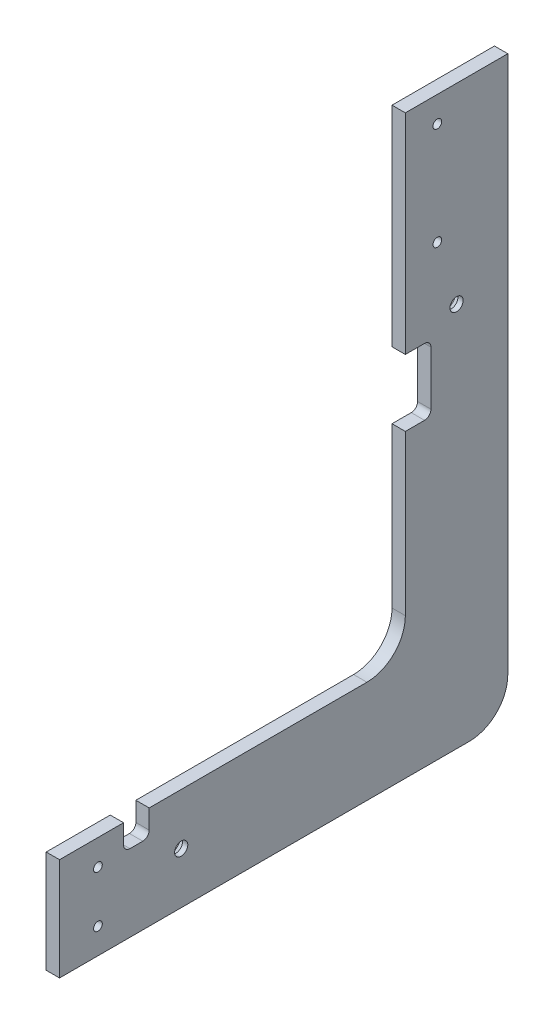
ISO-10303-21;
HEADER;
FILE_DESCRIPTION(('STEP AP214'),'2;1');
FILE_NAME('part.step','',(''),(''),'','','');
FILE_SCHEMA(('AUTOMOTIVE_DESIGN { 1 0 10303 214 1 1 1 1 }'));
ENDSEC;
DATA;
#1=APPLICATION_CONTEXT('core data for automotive mechanical design processes');
#2=APPLICATION_PROTOCOL_DEFINITION('international standard','automotive_design',2000,#1);
#3=PRODUCT_CONTEXT('',#1,'mechanical');
#4=PRODUCT('Part','Part','',(#3));
#5=PRODUCT_RELATED_PRODUCT_CATEGORY('part','',(#4));
#6=PRODUCT_DEFINITION_FORMATION('','',#4);
#7=PRODUCT_DEFINITION_CONTEXT('part definition',#1,'design');
#8=PRODUCT_DEFINITION('design','',#6,#7);
#9=PRODUCT_DEFINITION_SHAPE('','',#8);
#10=(LENGTH_UNIT() NAMED_UNIT(*) SI_UNIT(.MILLI.,.METRE.));
#11=(NAMED_UNIT(*) PLANE_ANGLE_UNIT() SI_UNIT($,.RADIAN.));
#12=(NAMED_UNIT(*) SI_UNIT($,.STERADIAN.) SOLID_ANGLE_UNIT());
#13=UNCERTAINTY_MEASURE_WITH_UNIT(LENGTH_MEASURE(1.E-05),#10,'distance_accuracy_value','');
#14=(GEOMETRIC_REPRESENTATION_CONTEXT(3) GLOBAL_UNCERTAINTY_ASSIGNED_CONTEXT((#13)) GLOBAL_UNIT_ASSIGNED_CONTEXT((#10,
#11,#12)) REPRESENTATION_CONTEXT('',''));
#15=CARTESIAN_POINT('',(0.,0.,0.));
#16=DIRECTION('',(0.,0.,1.));
#17=DIRECTION('',(1.,0.,0.));
#18=AXIS2_PLACEMENT_3D('',#15,#16,#17);
#19=CARTESIAN_POINT('',(6.604,-234.95,0.));
#20=DIRECTION('',(0.,1.,0.));
#21=DIRECTION('',(0.,0.,1.));
#22=AXIS2_PLACEMENT_3D('',#19,#20,#21);
#23=PLANE('',#22);
#24=DIRECTION('',(-1.,0.,0.));
#25=VECTOR('',#24,1.);
#26=CARTESIAN_POINT('',(6.604,-234.95,-44.45));
#27=LINE('',#26,#25);
#28=CARTESIAN_POINT('',(6.604,-234.95,-44.45));
#29=VERTEX_POINT('',#28);
#30=CARTESIAN_POINT('',(0.,-234.95,-44.45));
#31=VERTEX_POINT('',#30);
#32=EDGE_CURVE('E215',#29,#31,#27,.T.);
#33=ORIENTED_EDGE('',*,*,#32,.F.);
#34=DIRECTION('',(0.,0.,-1.));
#35=VECTOR('',#34,1.);
#36=CARTESIAN_POINT('',(6.604,-234.95,0.));
#37=LINE('',#36,#35);
#38=CARTESIAN_POINT('',(6.604,-234.95,-152.4));
#39=VERTEX_POINT('',#38);
#40=EDGE_CURVE('E195',#29,#39,#37,.T.);
#41=ORIENTED_EDGE('',*,*,#40,.T.);
#42=DIRECTION('',(-1.,0.,0.));
#43=VECTOR('',#42,1.);
#44=CARTESIAN_POINT('',(6.604,-234.95,-152.4));
#45=LINE('',#44,#43);
#46=CARTESIAN_POINT('',(0.,-234.95,-152.4));
#47=VERTEX_POINT('',#46);
#48=EDGE_CURVE('E44',#39,#47,#45,.T.);
#49=ORIENTED_EDGE('',*,*,#48,.T.);
#50=DIRECTION('',(0.,0.,-1.));
#51=VECTOR('',#50,1.);
#52=CARTESIAN_POINT('',(0.,-234.95,0.));
#53=LINE('',#52,#51);
#54=EDGE_CURVE('E348',#31,#47,#53,.T.);
#55=ORIENTED_EDGE('',*,*,#54,.F.);
#56=EDGE_LOOP('',(#33,#41,#49,#55));
#57=FACE_BOUND('',#56,.T.);
#58=ADVANCED_FACE('F36',(#57),#23,.T.);
#59=CARTESIAN_POINT('',(6.604,0.,-171.45));
#60=DIRECTION('',(0.,0.,-1.));
#61=DIRECTION('',(0.,1.,0.));
#62=AXIS2_PLACEMENT_3D('',#59,#60,#61);
#63=PLANE('',#62);
#64=DIRECTION('',(0.,-1.,0.));
#65=VECTOR('',#64,1.);
#66=CARTESIAN_POINT('',(6.604,0.,-171.45));
#67=LINE('',#66,#65);
#68=CARTESIAN_POINT('',(6.604,-136.779,-171.45));
#69=VERTEX_POINT('',#68);
#70=CARTESIAN_POINT('',(6.604,-215.9,-171.45));
#71=VERTEX_POINT('',#70);
#72=EDGE_CURVE('E324',#69,#71,#67,.T.);
#73=ORIENTED_EDGE('',*,*,#72,.F.);
#74=DIRECTION('',(-1.,0.,0.));
#75=VECTOR('',#74,1.);
#76=CARTESIAN_POINT('',(6.604,-136.779,-171.45));
#77=LINE('',#76,#75);
#78=CARTESIAN_POINT('',(0.,-136.779,-171.45));
#79=VERTEX_POINT('',#78);
#80=EDGE_CURVE('E253',#69,#79,#77,.T.);
#81=ORIENTED_EDGE('',*,*,#80,.T.);
#82=DIRECTION('',(0.,-1.,0.));
#83=VECTOR('',#82,1.);
#84=CARTESIAN_POINT('',(0.,0.,-171.45));
#85=LINE('',#84,#83);
#86=CARTESIAN_POINT('',(0.,-215.9,-171.45));
#87=VERTEX_POINT('',#86);
#88=EDGE_CURVE('E319',#79,#87,#85,.T.);
#89=ORIENTED_EDGE('',*,*,#88,.T.);
#90=DIRECTION('',(-1.,0.,0.));
#91=VECTOR('',#90,1.);
#92=CARTESIAN_POINT('',(6.604,-215.9,-171.45));
#93=LINE('',#92,#91);
#94=EDGE_CURVE('E11',#71,#87,#93,.T.);
#95=ORIENTED_EDGE('',*,*,#94,.F.);
#96=EDGE_LOOP('',(#73,#81,#89,#95));
#97=FACE_BOUND('',#96,.T.);
#98=ADVANCED_FACE('F449',(#97),#63,.F.);
#99=CARTESIAN_POINT('',(0.,0.,-171.45));
#100=VERTEX_POINT('',#99);
#101=CARTESIAN_POINT('',(0.,-103.759,-171.45));
#102=VERTEX_POINT('',#101);
#103=EDGE_CURVE('E342',#100,#102,#85,.T.);
#104=ORIENTED_EDGE('',*,*,#103,.T.);
#105=DIRECTION('',(-1.,0.,0.));
#106=VECTOR('',#105,1.);
#107=CARTESIAN_POINT('',(6.604,-103.759,-171.45));
#108=LINE('',#107,#106);
#109=CARTESIAN_POINT('',(6.604,-103.759,-171.45));
#110=VERTEX_POINT('',#109);
#111=EDGE_CURVE('E59',#110,#102,#108,.T.);
#112=ORIENTED_EDGE('',*,*,#111,.F.);
#113=CARTESIAN_POINT('',(6.604,0.,-171.45));
#114=VERTEX_POINT('',#113);
#115=EDGE_CURVE('E320',#114,#110,#67,.T.);
#116=ORIENTED_EDGE('',*,*,#115,.F.);
#117=DIRECTION('',(-1.,0.,0.));
#118=VECTOR('',#117,1.);
#119=CARTESIAN_POINT('',(6.604,0.,-171.45));
#120=LINE('',#119,#118);
#121=EDGE_CURVE('E341',#114,#100,#120,.T.);
#122=ORIENTED_EDGE('',*,*,#121,.T.);
#123=EDGE_LOOP('',(#104,#112,#116,#122));
#124=FACE_BOUND('',#123,.T.);
#125=ADVANCED_FACE('F38',(#124),#63,.F.);
#126=CARTESIAN_POINT('',(6.604,-215.9,-152.4));
#127=DIRECTION('',(-1.,0.,0.));
#128=DIRECTION('',(0.,0.,1.));
#129=AXIS2_PLACEMENT_3D('',#126,#127,#128);
#130=CYLINDRICAL_SURFACE('',#129,19.05);
#131=CARTESIAN_POINT('',(0.,-215.9,-152.4));
#132=DIRECTION('',(1.,0.,0.));
#133=DIRECTION('',(0.,0.,-1.));
#134=AXIS2_PLACEMENT_3D('',#131,#132,#133);
#135=CIRCLE('',#134,19.05);
#136=EDGE_CURVE('E345',#87,#47,#135,.F.);
#137=ORIENTED_EDGE('',*,*,#136,.T.);
#138=ORIENTED_EDGE('',*,*,#48,.F.);
#139=CARTESIAN_POINT('',(6.604,-215.9,-152.4));
#140=DIRECTION('',(1.,0.,0.));
#141=DIRECTION('',(0.,0.,-1.));
#142=AXIS2_PLACEMENT_3D('',#139,#140,#141);
#143=CIRCLE('',#142,19.05);
#144=EDGE_CURVE('E323',#71,#39,#143,.F.);
#145=ORIENTED_EDGE('',*,*,#144,.F.);
#146=ORIENTED_EDGE('',*,*,#94,.T.);
#147=EDGE_LOOP('',(#137,#138,#145,#146));
#148=FACE_BOUND('',#147,.T.);
#149=ADVANCED_FACE('F384',(#148),#130,.F.);
#150=DIRECTION('',(-1.,0.,0.));
#151=VECTOR('',#150,1.);
#152=CARTESIAN_POINT('',(6.604,-234.95,-31.75));
#153=LINE('',#152,#151);
#154=CARTESIAN_POINT('',(6.604,-234.95,-31.75));
#155=VERTEX_POINT('',#154);
#156=CARTESIAN_POINT('',(0.,-234.95,-31.75));
#157=VERTEX_POINT('',#156);
#158=EDGE_CURVE('E218',#155,#157,#153,.T.);
#159=ORIENTED_EDGE('',*,*,#158,.T.);
#160=CARTESIAN_POINT('',(0.,-234.95,0.));
#161=VERTEX_POINT('',#160);
#162=EDGE_CURVE('E349',#161,#157,#53,.T.);
#163=ORIENTED_EDGE('',*,*,#162,.F.);
#164=DIRECTION('',(-1.,0.,0.));
#165=VECTOR('',#164,1.);
#166=CARTESIAN_POINT('',(6.604,-234.95,0.));
#167=LINE('',#166,#165);
#168=CARTESIAN_POINT('',(6.604,-234.95,0.));
#169=VERTEX_POINT('',#168);
#170=EDGE_CURVE('E376',#169,#161,#167,.T.);
#171=ORIENTED_EDGE('',*,*,#170,.F.);
#172=EDGE_CURVE('E326',#169,#155,#37,.T.);
#173=ORIENTED_EDGE('',*,*,#172,.T.);
#174=EDGE_LOOP('',(#159,#163,#171,#173));
#175=FACE_BOUND('',#174,.T.);
#176=ADVANCED_FACE('F404',(#175),#23,.T.);
#177=CARTESIAN_POINT('',(6.604,0.,0.));
#178=DIRECTION('',(0.,0.,-1.));
#179=DIRECTION('',(-1.,0.,0.));
#180=AXIS2_PLACEMENT_3D('',#177,#178,#179);
#181=PLANE('',#180);
#182=DIRECTION('',(0.,-1.,0.));
#183=VECTOR('',#182,1.);
#184=CARTESIAN_POINT('',(0.,0.,0.));
#185=LINE('',#184,#183);
#186=CARTESIAN_POINT('',(0.,-285.75,0.));
#187=VERTEX_POINT('',#186);
#188=EDGE_CURVE('E352',#161,#187,#185,.T.);
#189=ORIENTED_EDGE('',*,*,#188,.T.);
#190=DIRECTION('',(-1.,0.,0.));
#191=VECTOR('',#190,1.);
#192=CARTESIAN_POINT('',(6.604,-285.75,0.));
#193=LINE('',#192,#191);
#194=CARTESIAN_POINT('',(6.604,-285.75,0.));
#195=VERTEX_POINT('',#194);
#196=EDGE_CURVE('E373',#195,#187,#193,.T.);
#197=ORIENTED_EDGE('',*,*,#196,.F.);
#198=DIRECTION('',(0.,-1.,0.));
#199=VECTOR('',#198,1.);
#200=CARTESIAN_POINT('',(6.604,0.,0.));
#201=LINE('',#200,#199);
#202=EDGE_CURVE('E329',#169,#195,#201,.T.);
#203=ORIENTED_EDGE('',*,*,#202,.F.);
#204=ORIENTED_EDGE('',*,*,#170,.T.);
#205=EDGE_LOOP('',(#189,#197,#203,#204));
#206=FACE_BOUND('',#205,.T.);
#207=ADVANCED_FACE('F410',(#206),#181,.F.);
#208=CARTESIAN_POINT('',(6.604,-285.75,0.));
#209=DIRECTION('',(0.,1.,0.));
#210=DIRECTION('',(0.,0.,1.));
#211=AXIS2_PLACEMENT_3D('',#208,#209,#210);
#212=PLANE('',#211);
#213=DIRECTION('',(0.,0.,-1.));
#214=VECTOR('',#213,1.);
#215=CARTESIAN_POINT('',(0.,-285.75,0.));
#216=LINE('',#215,#214);
#217=CARTESIAN_POINT('',(0.,-285.75,-203.2));
#218=VERTEX_POINT('',#217);
#219=EDGE_CURVE('E354',#187,#218,#216,.T.);
#220=ORIENTED_EDGE('',*,*,#219,.T.);
#221=DIRECTION('',(-1.,0.,0.));
#222=VECTOR('',#221,1.);
#223=CARTESIAN_POINT('',(6.604,-285.75,-203.2));
#224=LINE('',#223,#222);
#225=CARTESIAN_POINT('',(6.604,-285.75,-203.2));
#226=VERTEX_POINT('',#225);
#227=EDGE_CURVE('E370',#226,#218,#224,.T.);
#228=ORIENTED_EDGE('',*,*,#227,.F.);
#229=DIRECTION('',(0.,0.,-1.));
#230=VECTOR('',#229,1.);
#231=CARTESIAN_POINT('',(6.604,-285.75,0.));
#232=LINE('',#231,#230);
#233=EDGE_CURVE('E331',#195,#226,#232,.T.);
#234=ORIENTED_EDGE('',*,*,#233,.F.);
#235=ORIENTED_EDGE('',*,*,#196,.T.);
#236=EDGE_LOOP('',(#220,#228,#234,#235));
#237=FACE_BOUND('',#236,.T.);
#238=ADVANCED_FACE('F414',(#237),#212,.F.);
#239=CARTESIAN_POINT('',(6.604,-266.7,-203.2));
#240=DIRECTION('',(-1.,0.,0.));
#241=DIRECTION('',(0.,0.,1.));
#242=AXIS2_PLACEMENT_3D('',#239,#240,#241);
#243=CYLINDRICAL_SURFACE('',#242,19.0500000000001);
#244=CARTESIAN_POINT('',(0.,-266.7,-203.2));
#245=DIRECTION('',(1.,0.,0.));
#246=DIRECTION('',(0.,0.,-1.));
#247=AXIS2_PLACEMENT_3D('',#244,#245,#246);
#248=CIRCLE('',#247,19.0500000000001);
#249=CARTESIAN_POINT('',(0.,-266.7,-222.25));
#250=VERTEX_POINT('',#249);
#251=EDGE_CURVE('E356',#218,#250,#248,.T.);
#252=ORIENTED_EDGE('',*,*,#251,.T.);
#253=DIRECTION('',(-1.,0.,0.));
#254=VECTOR('',#253,1.);
#255=CARTESIAN_POINT('',(6.604,-266.7,-222.25));
#256=LINE('',#255,#254);
#257=CARTESIAN_POINT('',(6.604,-266.7,-222.25));
#258=VERTEX_POINT('',#257);
#259=EDGE_CURVE('E368',#258,#250,#256,.T.);
#260=ORIENTED_EDGE('',*,*,#259,.F.);
#261=CARTESIAN_POINT('',(6.604,-266.7,-203.2));
#262=DIRECTION('',(1.,0.,0.));
#263=DIRECTION('',(0.,0.,-1.));
#264=AXIS2_PLACEMENT_3D('',#261,#262,#263);
#265=CIRCLE('',#264,19.0500000000001);
#266=EDGE_CURVE('E333',#226,#258,#265,.T.);
#267=ORIENTED_EDGE('',*,*,#266,.F.);
#268=ORIENTED_EDGE('',*,*,#227,.T.);
#269=EDGE_LOOP('',(#252,#260,#267,#268));
#270=FACE_BOUND('',#269,.T.);
#271=ADVANCED_FACE('F421',(#270),#243,.T.);
#272=CARTESIAN_POINT('',(6.604,0.,-222.25));
#273=DIRECTION('',(0.,0.,-1.));
#274=DIRECTION('',(0.,1.,0.));
#275=AXIS2_PLACEMENT_3D('',#272,#273,#274);
#276=PLANE('',#275);
#277=DIRECTION('',(0.,-1.,0.));
#278=VECTOR('',#277,1.);
#279=CARTESIAN_POINT('',(0.,0.,-222.25));
#280=LINE('',#279,#278);
#281=CARTESIAN_POINT('',(0.,0.,-222.25));
#282=VERTEX_POINT('',#281);
#283=EDGE_CURVE('E359',#282,#250,#280,.T.);
#284=ORIENTED_EDGE('',*,*,#283,.F.);
#285=DIRECTION('',(-1.,0.,0.));
#286=VECTOR('',#285,1.);
#287=CARTESIAN_POINT('',(6.604,0.,-222.25));
#288=LINE('',#287,#286);
#289=CARTESIAN_POINT('',(6.604,0.,-222.25));
#290=VERTEX_POINT('',#289);
#291=EDGE_CURVE('E366',#290,#282,#288,.T.);
#292=ORIENTED_EDGE('',*,*,#291,.F.);
#293=DIRECTION('',(0.,-1.,0.));
#294=VECTOR('',#293,1.);
#295=CARTESIAN_POINT('',(6.604,0.,-222.25));
#296=LINE('',#295,#294);
#297=EDGE_CURVE('E335',#290,#258,#296,.T.);
#298=ORIENTED_EDGE('',*,*,#297,.T.);
#299=ORIENTED_EDGE('',*,*,#259,.T.);
#300=EDGE_LOOP('',(#284,#292,#298,#299));
#301=FACE_BOUND('',#300,.T.);
#302=ADVANCED_FACE('F424',(#301),#276,.T.);
#303=CARTESIAN_POINT('',(6.604,0.,0.));
#304=DIRECTION('',(0.,1.,0.));
#305=DIRECTION('',(0.,0.,1.));
#306=AXIS2_PLACEMENT_3D('',#303,#304,#305);
#307=PLANE('',#306);
#308=DIRECTION('',(0.,0.,-1.));
#309=VECTOR('',#308,1.);
#310=CARTESIAN_POINT('',(0.,0.,0.));
#311=LINE('',#310,#309);
#312=EDGE_CURVE('E362',#100,#282,#311,.T.);
#313=ORIENTED_EDGE('',*,*,#312,.F.);
#314=ORIENTED_EDGE('',*,*,#121,.F.);
#315=DIRECTION('',(0.,0.,-1.));
#316=VECTOR('',#315,1.);
#317=CARTESIAN_POINT('',(6.604,0.,0.));
#318=LINE('',#317,#316);
#319=EDGE_CURVE('E338',#114,#290,#318,.T.);
#320=ORIENTED_EDGE('',*,*,#319,.T.);
#321=ORIENTED_EDGE('',*,*,#291,.T.);
#322=EDGE_LOOP('',(#313,#314,#320,#321));
#323=FACE_BOUND('',#322,.T.);
#324=ADVANCED_FACE('F427',(#323),#307,.T.);
#325=CARTESIAN_POINT('',(6.604,0.,0.));
#326=DIRECTION('',(1.,0.,0.));
#327=DIRECTION('',(0.,0.,-1.));
#328=AXIS2_PLACEMENT_3D('',#325,#326,#327);
#329=PLANE('',#328);
#330=DIRECTION('',(0.,-1.,0.));
#331=VECTOR('',#330,1.);
#332=CARTESIAN_POINT('',(6.604,-234.95,-44.45));
#333=LINE('',#332,#331);
#334=CARTESIAN_POINT('',(6.604,-244.475,-44.45));
#335=VERTEX_POINT('',#334);
#336=EDGE_CURVE('E175',#29,#335,#333,.T.);
#337=ORIENTED_EDGE('',*,*,#336,.T.);
#338=CARTESIAN_POINT('',(6.604,-244.475,-41.275));
#339=DIRECTION('',(-1.,0.,0.));
#340=DIRECTION('',(0.,0.,-1.));
#341=AXIS2_PLACEMENT_3D('',#338,#339,#340);
#342=CIRCLE('',#341,3.17500000000001);
#343=CARTESIAN_POINT('',(6.604,-247.65,-41.275));
#344=VERTEX_POINT('',#343);
#345=EDGE_CURVE('E184',#335,#344,#342,.T.);
#346=ORIENTED_EDGE('',*,*,#345,.T.);
#347=DIRECTION('',(0.,0.,1.));
#348=VECTOR('',#347,1.);
#349=CARTESIAN_POINT('',(6.604,-247.65,-41.275));
#350=LINE('',#349,#348);
#351=CARTESIAN_POINT('',(6.604,-247.65,-34.925));
#352=VERTEX_POINT('',#351);
#353=EDGE_CURVE('E189',#344,#352,#350,.T.);
#354=ORIENTED_EDGE('',*,*,#353,.T.);
#355=CARTESIAN_POINT('',(6.604,-244.475,-34.925));
#356=DIRECTION('',(-1.,0.,0.));
#357=DIRECTION('',(0.,0.,1.));
#358=AXIS2_PLACEMENT_3D('',#355,#356,#357);
#359=CIRCLE('',#358,3.175);
#360=CARTESIAN_POINT('',(6.604,-244.475,-31.75));
#361=VERTEX_POINT('',#360);
#362=EDGE_CURVE('E202',#352,#361,#359,.T.);
#363=ORIENTED_EDGE('',*,*,#362,.T.);
#364=DIRECTION('',(0.,1.,0.));
#365=VECTOR('',#364,1.);
#366=CARTESIAN_POINT('',(6.604,-234.95,-31.75));
#367=LINE('',#366,#365);
#368=EDGE_CURVE('E181',#361,#155,#367,.T.);
#369=ORIENTED_EDGE('',*,*,#368,.T.);
#370=ORIENTED_EDGE('',*,*,#172,.F.);
#371=ORIENTED_EDGE('',*,*,#202,.T.);
#372=ORIENTED_EDGE('',*,*,#233,.T.);
#373=ORIENTED_EDGE('',*,*,#266,.T.);
#374=ORIENTED_EDGE('',*,*,#297,.F.);
#375=ORIENTED_EDGE('',*,*,#319,.F.);
#376=ORIENTED_EDGE('',*,*,#115,.T.);
#377=DIRECTION('',(0.,0.,-1.));
#378=VECTOR('',#377,1.);
#379=CARTESIAN_POINT('',(6.604,-103.759,-171.45));
#380=LINE('',#379,#378);
#381=CARTESIAN_POINT('',(6.604,-103.759,-180.975));
#382=VERTEX_POINT('',#381);
#383=EDGE_CURVE('E226',#110,#382,#380,.T.);
#384=ORIENTED_EDGE('',*,*,#383,.T.);
#385=CARTESIAN_POINT('',(6.604,-106.934,-180.975));
#386=DIRECTION('',(-1.,0.,0.));
#387=DIRECTION('',(0.,0.,-1.));
#388=AXIS2_PLACEMENT_3D('',#385,#386,#387);
#389=CIRCLE('',#388,3.175);
#390=CARTESIAN_POINT('',(6.604,-106.934,-184.15));
#391=VERTEX_POINT('',#390);
#392=EDGE_CURVE('E229',#382,#391,#389,.T.);
#393=ORIENTED_EDGE('',*,*,#392,.T.);
#394=DIRECTION('',(0.,-1.,0.));
#395=VECTOR('',#394,1.);
#396=CARTESIAN_POINT('',(6.604,-106.934,-184.15));
#397=LINE('',#396,#395);
#398=CARTESIAN_POINT('',(6.604,-133.604,-184.15));
#399=VERTEX_POINT('',#398);
#400=EDGE_CURVE('E233',#391,#399,#397,.T.);
#401=ORIENTED_EDGE('',*,*,#400,.T.);
#402=CARTESIAN_POINT('',(6.604,-133.604,-180.975));
#403=DIRECTION('',(-1.,0.,0.));
#404=DIRECTION('',(0.,0.,-1.));
#405=AXIS2_PLACEMENT_3D('',#402,#403,#404);
#406=CIRCLE('',#405,3.175);
#407=CARTESIAN_POINT('',(6.604,-136.779,-180.975));
#408=VERTEX_POINT('',#407);
#409=EDGE_CURVE('E236',#399,#408,#406,.T.);
#410=ORIENTED_EDGE('',*,*,#409,.T.);
#411=DIRECTION('',(0.,0.,1.));
#412=VECTOR('',#411,1.);
#413=CARTESIAN_POINT('',(6.604,-136.779,-171.45));
#414=LINE('',#413,#412);
#415=EDGE_CURVE('E239',#408,#69,#414,.T.);
#416=ORIENTED_EDGE('',*,*,#415,.T.);
#417=ORIENTED_EDGE('',*,*,#72,.T.);
#418=ORIENTED_EDGE('',*,*,#144,.T.);
#419=ORIENTED_EDGE('',*,*,#40,.F.);
#420=EDGE_LOOP('',(#337,#346,#354,#363,#369,#370,#371,#372,#373,#374,#375,#376,#384,#393,#401,
#410,#416,#417,#418,#419));
#421=FACE_BOUND('',#420,.T.);
#422=CARTESIAN_POINT('',(6.604,-94.869,-196.85));
#423=DIRECTION('',(-1.,0.,0.));
#424=DIRECTION('',(0.,0.,1.));
#425=AXIS2_PLACEMENT_3D('',#422,#423,#424);
#426=CIRCLE('',#425,3.2639);
#427=CARTESIAN_POINT('',(6.604,-94.869,-193.5861));
#428=VERTEX_POINT('',#427);
#429=EDGE_CURVE('E271',#428,#428,#426,.T.);
#430=ORIENTED_EDGE('',*,*,#429,.T.);
#431=EDGE_LOOP('',(#430));
#432=FACE_BOUND('',#431,.T.);
#433=CARTESIAN_POINT('',(6.604,-260.35,-60.325));
#434=DIRECTION('',(-1.,0.,0.));
#435=DIRECTION('',(0.,0.,1.));
#436=AXIS2_PLACEMENT_3D('',#433,#434,#435);
#437=CIRCLE('',#436,3.26389999999999);
#438=CARTESIAN_POINT('',(6.604,-260.35,-57.0611));
#439=VERTEX_POINT('',#438);
#440=EDGE_CURVE('E280',#439,#439,#437,.T.);
#441=ORIENTED_EDGE('',*,*,#440,.T.);
#442=EDGE_LOOP('',(#441));
#443=FACE_BOUND('',#442,.T.);
#444=CARTESIAN_POINT('',(6.604,-247.65,-19.05));
#445=DIRECTION('',(-1.,0.,0.));
#446=DIRECTION('',(0.,0.,1.));
#447=AXIS2_PLACEMENT_3D('',#444,#445,#446);
#448=CIRCLE('',#447,2.15265000000001);
#449=CARTESIAN_POINT('',(6.604,-247.65,-16.89735));
#450=VERTEX_POINT('',#449);
#451=EDGE_CURVE('E289',#450,#450,#448,.T.);
#452=ORIENTED_EDGE('',*,*,#451,.T.);
#453=EDGE_LOOP('',(#452));
#454=FACE_BOUND('',#453,.T.);
#455=CARTESIAN_POINT('',(6.604,-273.05,-19.05));
#456=DIRECTION('',(-1.,0.,0.));
#457=DIRECTION('',(0.,0.,1.));
#458=AXIS2_PLACEMENT_3D('',#455,#456,#457);
#459=CIRCLE('',#458,2.15264999999998);
#460=CARTESIAN_POINT('',(6.604,-273.05,-16.89735));
#461=VERTEX_POINT('',#460);
#462=EDGE_CURVE('E298',#461,#461,#459,.T.);
#463=ORIENTED_EDGE('',*,*,#462,.T.);
#464=EDGE_LOOP('',(#463));
#465=FACE_BOUND('',#464,.T.);
#466=CARTESIAN_POINT('',(6.604,-12.7,-187.325));
#467=DIRECTION('',(-1.,0.,0.));
#468=DIRECTION('',(0.,0.,1.));
#469=AXIS2_PLACEMENT_3D('',#466,#467,#468);
#470=CIRCLE('',#469,2.15265);
#471=CARTESIAN_POINT('',(6.604,-12.7,-185.17235));
#472=VERTEX_POINT('',#471);
#473=EDGE_CURVE('E307',#472,#472,#470,.T.);
#474=ORIENTED_EDGE('',*,*,#473,.T.);
#475=EDGE_LOOP('',(#474));
#476=FACE_BOUND('',#475,.T.);
#477=CARTESIAN_POINT('',(6.604,-63.5,-187.325));
#478=DIRECTION('',(-1.,0.,0.));
#479=DIRECTION('',(0.,0.,1.));
#480=AXIS2_PLACEMENT_3D('',#477,#478,#479);
#481=CIRCLE('',#480,2.15265);
#482=CARTESIAN_POINT('',(6.604,-63.5,-185.17235));
#483=VERTEX_POINT('',#482);
#484=EDGE_CURVE('E316',#483,#483,#481,.T.);
#485=ORIENTED_EDGE('',*,*,#484,.T.);
#486=EDGE_LOOP('',(#485));
#487=FACE_BOUND('',#486,.T.);
#488=ADVANCED_FACE('F192',(#421,#432,#443,#454,#465,#476,#487),#329,.T.);
#489=CARTESIAN_POINT('',(0.,0.,0.));
#490=DIRECTION('',(1.,0.,0.));
#491=DIRECTION('',(0.,0.,-1.));
#492=AXIS2_PLACEMENT_3D('',#489,#490,#491);
#493=PLANE('',#492);
#494=CARTESIAN_POINT('',(0.,-94.869,-196.85));
#495=DIRECTION('',(-1.,0.,0.));
#496=DIRECTION('',(0.,0.,1.));
#497=AXIS2_PLACEMENT_3D('',#494,#495,#496);
#498=CIRCLE('',#497,6.7437);
#499=CARTESIAN_POINT('',(0.,-94.869,-190.1063));
#500=VERTEX_POINT('',#499);
#501=EDGE_CURVE('E256',#500,#500,#498,.T.);
#502=ORIENTED_EDGE('',*,*,#501,.F.);
#503=EDGE_LOOP('',(#502));
#504=FACE_BOUND('',#503,.T.);
#505=CARTESIAN_POINT('',(0.,-260.35,-60.325));
#506=DIRECTION('',(-1.,0.,0.));
#507=DIRECTION('',(0.,0.,1.));
#508=AXIS2_PLACEMENT_3D('',#505,#506,#507);
#509=CIRCLE('',#508,6.74370000000002);
#510=CARTESIAN_POINT('',(0.,-260.35,-53.5813));
#511=VERTEX_POINT('',#510);
#512=EDGE_CURVE('E274',#511,#511,#509,.T.);
#513=ORIENTED_EDGE('',*,*,#512,.F.);
#514=EDGE_LOOP('',(#513));
#515=FACE_BOUND('',#514,.T.);
#516=CARTESIAN_POINT('',(0.,-247.65,-19.05));
#517=DIRECTION('',(-1.,0.,0.));
#518=DIRECTION('',(0.,0.,1.));
#519=AXIS2_PLACEMENT_3D('',#516,#517,#518);
#520=CIRCLE('',#519,4.55929999999999);
#521=CARTESIAN_POINT('',(0.,-247.65,-14.4907000000001));
#522=VERTEX_POINT('',#521);
#523=EDGE_CURVE('E283',#522,#522,#520,.T.);
#524=ORIENTED_EDGE('',*,*,#523,.F.);
#525=EDGE_LOOP('',(#524));
#526=FACE_BOUND('',#525,.T.);
#527=CARTESIAN_POINT('',(0.,-273.05,-19.05));
#528=DIRECTION('',(-1.,0.,0.));
#529=DIRECTION('',(0.,0.,1.));
#530=AXIS2_PLACEMENT_3D('',#527,#528,#529);
#531=CIRCLE('',#530,4.55929999999999);
#532=CARTESIAN_POINT('',(0.,-273.05,-14.4907));
#533=VERTEX_POINT('',#532);
#534=EDGE_CURVE('E292',#533,#533,#531,.T.);
#535=ORIENTED_EDGE('',*,*,#534,.F.);
#536=EDGE_LOOP('',(#535));
#537=FACE_BOUND('',#536,.T.);
#538=CARTESIAN_POINT('',(0.,-12.7,-187.325));
#539=DIRECTION('',(-1.,0.,0.));
#540=DIRECTION('',(0.,0.,1.));
#541=AXIS2_PLACEMENT_3D('',#538,#539,#540);
#542=CIRCLE('',#541,4.5593);
#543=CARTESIAN_POINT('',(0.,-12.7,-182.7657));
#544=VERTEX_POINT('',#543);
#545=EDGE_CURVE('E301',#544,#544,#542,.T.);
#546=ORIENTED_EDGE('',*,*,#545,.F.);
#547=EDGE_LOOP('',(#546));
#548=FACE_BOUND('',#547,.T.);
#549=CARTESIAN_POINT('',(0.,-63.5,-187.325));
#550=DIRECTION('',(-1.,0.,0.));
#551=DIRECTION('',(0.,0.,1.));
#552=AXIS2_PLACEMENT_3D('',#549,#550,#551);
#553=CIRCLE('',#552,4.5593);
#554=CARTESIAN_POINT('',(0.,-63.5,-182.7657));
#555=VERTEX_POINT('',#554);
#556=EDGE_CURVE('E310',#555,#555,#553,.T.);
#557=ORIENTED_EDGE('',*,*,#556,.F.);
#558=EDGE_LOOP('',(#557));
#559=FACE_BOUND('',#558,.T.);
#560=CARTESIAN_POINT('',(0.,-244.475,-41.275));
#561=DIRECTION('',(-1.,0.,0.));
#562=DIRECTION('',(0.,0.,-1.));
#563=AXIS2_PLACEMENT_3D('',#560,#561,#562);
#564=CIRCLE('',#563,3.17500000000001);
#565=CARTESIAN_POINT('',(0.,-244.475,-44.45));
#566=VERTEX_POINT('',#565);
#567=CARTESIAN_POINT('',(0.,-247.65,-41.275));
#568=VERTEX_POINT('',#567);
#569=EDGE_CURVE('E208',#566,#568,#564,.T.);
#570=ORIENTED_EDGE('',*,*,#569,.F.);
#571=DIRECTION('',(0.,-1.,0.));
#572=VECTOR('',#571,1.);
#573=CARTESIAN_POINT('',(0.,-234.95,-44.45));
#574=LINE('',#573,#572);
#575=EDGE_CURVE('E51',#31,#566,#574,.T.);
#576=ORIENTED_EDGE('',*,*,#575,.F.);
#577=ORIENTED_EDGE('',*,*,#54,.T.);
#578=ORIENTED_EDGE('',*,*,#136,.F.);
#579=ORIENTED_EDGE('',*,*,#88,.F.);
#580=DIRECTION('',(0.,0.,1.));
#581=VECTOR('',#580,1.);
#582=CARTESIAN_POINT('',(0.,-136.779,-171.45));
#583=LINE('',#582,#581);
#584=CARTESIAN_POINT('',(0.,-136.779,-180.975));
#585=VERTEX_POINT('',#584);
#586=EDGE_CURVE('E230',#585,#79,#583,.T.);
#587=ORIENTED_EDGE('',*,*,#586,.F.);
#588=CARTESIAN_POINT('',(0.,-133.604,-180.975));
#589=DIRECTION('',(-1.,0.,0.));
#590=DIRECTION('',(0.,0.,-1.));
#591=AXIS2_PLACEMENT_3D('',#588,#589,#590);
#592=CIRCLE('',#591,3.175);
#593=CARTESIAN_POINT('',(0.,-133.604,-184.15));
#594=VERTEX_POINT('',#593);
#595=EDGE_CURVE('E249',#594,#585,#592,.T.);
#596=ORIENTED_EDGE('',*,*,#595,.F.);
#597=DIRECTION('',(0.,-1.,0.));
#598=VECTOR('',#597,1.);
#599=CARTESIAN_POINT('',(0.,-106.934,-184.15));
#600=LINE('',#599,#598);
#601=CARTESIAN_POINT('',(0.,-106.934,-184.15));
#602=VERTEX_POINT('',#601);
#603=EDGE_CURVE('E246',#602,#594,#600,.T.);
#604=ORIENTED_EDGE('',*,*,#603,.F.);
#605=CARTESIAN_POINT('',(0.,-106.934,-180.975));
#606=DIRECTION('',(-1.,0.,0.));
#607=DIRECTION('',(0.,0.,-1.));
#608=AXIS2_PLACEMENT_3D('',#605,#606,#607);
#609=CIRCLE('',#608,3.175);
#610=CARTESIAN_POINT('',(0.,-103.759,-180.975));
#611=VERTEX_POINT('',#610);
#612=EDGE_CURVE('E243',#611,#602,#609,.T.);
#613=ORIENTED_EDGE('',*,*,#612,.F.);
#614=DIRECTION('',(0.,0.,-1.));
#615=VECTOR('',#614,1.);
#616=CARTESIAN_POINT('',(0.,-103.759,-171.45));
#617=LINE('',#616,#615);
#618=EDGE_CURVE('E217',#102,#611,#617,.T.);
#619=ORIENTED_EDGE('',*,*,#618,.F.);
#620=ORIENTED_EDGE('',*,*,#103,.F.);
#621=ORIENTED_EDGE('',*,*,#312,.T.);
#622=ORIENTED_EDGE('',*,*,#283,.T.);
#623=ORIENTED_EDGE('',*,*,#251,.F.);
#624=ORIENTED_EDGE('',*,*,#219,.F.);
#625=ORIENTED_EDGE('',*,*,#188,.F.);
#626=ORIENTED_EDGE('',*,*,#162,.T.);
#627=DIRECTION('',(0.,1.,0.));
#628=VECTOR('',#627,1.);
#629=CARTESIAN_POINT('',(0.,-234.95,-31.75));
#630=LINE('',#629,#628);
#631=CARTESIAN_POINT('',(0.,-244.475,-31.75));
#632=VERTEX_POINT('',#631);
#633=EDGE_CURVE('E196',#632,#157,#630,.T.);
#634=ORIENTED_EDGE('',*,*,#633,.F.);
#635=CARTESIAN_POINT('',(0.,-244.475,-34.925));
#636=DIRECTION('',(-1.,0.,0.));
#637=DIRECTION('',(0.,0.,1.));
#638=AXIS2_PLACEMENT_3D('',#635,#636,#637);
#639=CIRCLE('',#638,3.175);
#640=CARTESIAN_POINT('',(0.,-247.65,-34.925));
#641=VERTEX_POINT('',#640);
#642=EDGE_CURVE('E198',#641,#632,#639,.T.);
#643=ORIENTED_EDGE('',*,*,#642,.F.);
#644=DIRECTION('',(0.,0.,1.));
#645=VECTOR('',#644,1.);
#646=CARTESIAN_POINT('',(0.,-247.65,-41.275));
#647=LINE('',#646,#645);
#648=EDGE_CURVE('E210',#568,#641,#647,.T.);
#649=ORIENTED_EDGE('',*,*,#648,.F.);
#650=EDGE_LOOP('',(#570,#576,#577,#578,#579,#587,#596,#604,#613,#619,#620,#621,#622,#623,#624,
#625,#626,#634,#643,#649));
#651=FACE_BOUND('',#650,.T.);
#652=ADVANCED_FACE('F388',(#504,#515,#526,#537,#548,#559,#651),#493,.F.);
#653=CARTESIAN_POINT('',(0.,-63.5,-187.325));
#654=DIRECTION('',(-1.,0.,0.));
#655=DIRECTION('',(0.,0.,1.));
#656=AXIS2_PLACEMENT_3D('',#653,#654,#655);
#657=CYLINDRICAL_SURFACE('',#656,2.15265);
#658=ORIENTED_EDGE('',*,*,#484,.F.);
#659=EDGE_LOOP('',(#658));
#660=FACE_BOUND('',#659,.T.);
#661=CARTESIAN_POINT('',(2.76853412723844,-63.5,-187.325));
#662=DIRECTION('',(-1.,0.,0.));
#663=DIRECTION('',(0.,0.,1.));
#664=AXIS2_PLACEMENT_3D('',#661,#662,#663);
#665=CIRCLE('',#664,2.15265);
#666=CARTESIAN_POINT('',(2.76853412723844,-63.5,-185.17235));
#667=VERTEX_POINT('',#666);
#668=EDGE_CURVE('E313',#667,#667,#665,.T.);
#669=ORIENTED_EDGE('',*,*,#668,.T.);
#670=EDGE_LOOP('',(#669));
#671=FACE_BOUND('',#670,.T.);
#672=ADVANCED_FACE('F497',(#660,#671),#657,.F.);
#673=CARTESIAN_POINT('',(0.,-63.5,-187.325));
#674=DIRECTION('',(-1.,0.,0.));
#675=DIRECTION('',(0.,0.,1.));
#676=AXIS2_PLACEMENT_3D('',#673,#674,#675);
#677=CONICAL_SURFACE('',#676,4.5593,0.715584993317676);
#678=ORIENTED_EDGE('',*,*,#668,.F.);
#679=EDGE_LOOP('',(#678));
#680=FACE_BOUND('',#679,.T.);
#681=ORIENTED_EDGE('',*,*,#556,.T.);
#682=EDGE_LOOP('',(#681));
#683=FACE_BOUND('',#682,.T.);
#684=ADVANCED_FACE('F625',(#680,#683),#677,.F.);
#685=CARTESIAN_POINT('',(0.,-12.7,-187.325));
#686=DIRECTION('',(-1.,0.,0.));
#687=DIRECTION('',(0.,0.,1.));
#688=AXIS2_PLACEMENT_3D('',#685,#686,#687);
#689=CYLINDRICAL_SURFACE('',#688,2.15265);
#690=ORIENTED_EDGE('',*,*,#473,.F.);
#691=EDGE_LOOP('',(#690));
#692=FACE_BOUND('',#691,.T.);
#693=CARTESIAN_POINT('',(2.76853412723844,-12.7,-187.325));
#694=DIRECTION('',(-1.,0.,0.));
#695=DIRECTION('',(0.,0.,1.));
#696=AXIS2_PLACEMENT_3D('',#693,#694,#695);
#697=CIRCLE('',#696,2.15265);
#698=CARTESIAN_POINT('',(2.76853412723844,-12.7,-185.17235));
#699=VERTEX_POINT('',#698);
#700=EDGE_CURVE('E304',#699,#699,#697,.T.);
#701=ORIENTED_EDGE('',*,*,#700,.T.);
#702=EDGE_LOOP('',(#701));
#703=FACE_BOUND('',#702,.T.);
#704=ADVANCED_FACE('F621',(#692,#703),#689,.F.);
#705=CARTESIAN_POINT('',(0.,-12.7,-187.325));
#706=DIRECTION('',(-1.,0.,0.));
#707=DIRECTION('',(0.,0.,1.));
#708=AXIS2_PLACEMENT_3D('',#705,#706,#707);
#709=CONICAL_SURFACE('',#708,4.5593,0.715584993317675);
#710=ORIENTED_EDGE('',*,*,#700,.F.);
#711=EDGE_LOOP('',(#710));
#712=FACE_BOUND('',#711,.T.);
#713=ORIENTED_EDGE('',*,*,#545,.T.);
#714=EDGE_LOOP('',(#713));
#715=FACE_BOUND('',#714,.T.);
#716=ADVANCED_FACE('F617',(#712,#715),#709,.F.);
#717=CARTESIAN_POINT('',(0.,-273.05,-19.05));
#718=DIRECTION('',(-1.,0.,0.));
#719=DIRECTION('',(0.,0.,1.));
#720=AXIS2_PLACEMENT_3D('',#717,#718,#719);
#721=CYLINDRICAL_SURFACE('',#720,2.15264999999998);
#722=ORIENTED_EDGE('',*,*,#462,.F.);
#723=EDGE_LOOP('',(#722));
#724=FACE_BOUND('',#723,.T.);
#725=CARTESIAN_POINT('',(2.76853412723846,-273.05,-19.05));
#726=DIRECTION('',(-1.,0.,0.));
#727=DIRECTION('',(0.,0.,1.));
#728=AXIS2_PLACEMENT_3D('',#725,#726,#727);
#729=CIRCLE('',#728,2.15264999999998);
#730=CARTESIAN_POINT('',(2.76853412723846,-273.05,-16.89735));
#731=VERTEX_POINT('',#730);
#732=EDGE_CURVE('E295',#731,#731,#729,.T.);
#733=ORIENTED_EDGE('',*,*,#732,.T.);
#734=EDGE_LOOP('',(#733));
#735=FACE_BOUND('',#734,.T.);
#736=ADVANCED_FACE('F613',(#724,#735),#721,.F.);
#737=CARTESIAN_POINT('',(0.,-273.05,-19.05));
#738=DIRECTION('',(-1.,0.,0.));
#739=DIRECTION('',(0.,0.,1.));
#740=AXIS2_PLACEMENT_3D('',#737,#738,#739);
#741=CONICAL_SURFACE('',#740,4.55929999999999,0.715584993317674);
#742=ORIENTED_EDGE('',*,*,#732,.F.);
#743=EDGE_LOOP('',(#742));
#744=FACE_BOUND('',#743,.T.);
#745=ORIENTED_EDGE('',*,*,#534,.T.);
#746=EDGE_LOOP('',(#745));
#747=FACE_BOUND('',#746,.T.);
#748=ADVANCED_FACE('F609',(#744,#747),#741,.F.);
#749=CARTESIAN_POINT('',(0.,-247.65,-19.05));
#750=DIRECTION('',(-1.,0.,0.));
#751=DIRECTION('',(0.,0.,1.));
#752=AXIS2_PLACEMENT_3D('',#749,#750,#751);
#753=CYLINDRICAL_SURFACE('',#752,2.15264999999999);
#754=ORIENTED_EDGE('',*,*,#451,.F.);
#755=EDGE_LOOP('',(#754));
#756=FACE_BOUND('',#755,.T.);
#757=CARTESIAN_POINT('',(2.76853412723846,-247.65,-19.05));
#758=DIRECTION('',(-1.,0.,0.));
#759=DIRECTION('',(0.,0.,1.));
#760=AXIS2_PLACEMENT_3D('',#757,#758,#759);
#761=CIRCLE('',#760,2.15264999999998);
#762=CARTESIAN_POINT('',(2.76853412723846,-247.65,-16.8973500000001));
#763=VERTEX_POINT('',#762);
#764=EDGE_CURVE('E286',#763,#763,#761,.T.);
#765=ORIENTED_EDGE('',*,*,#764,.T.);
#766=EDGE_LOOP('',(#765));
#767=FACE_BOUND('',#766,.T.);
#768=ADVANCED_FACE('F605',(#756,#767),#753,.F.);
#769=CARTESIAN_POINT('',(0.,-247.65,-19.05));
#770=DIRECTION('',(-1.,0.,0.));
#771=DIRECTION('',(0.,0.,1.));
#772=AXIS2_PLACEMENT_3D('',#769,#770,#771);
#773=CONICAL_SURFACE('',#772,4.55929999999999,0.715584993317674);
#774=ORIENTED_EDGE('',*,*,#764,.F.);
#775=EDGE_LOOP('',(#774));
#776=FACE_BOUND('',#775,.T.);
#777=ORIENTED_EDGE('',*,*,#523,.T.);
#778=EDGE_LOOP('',(#777));
#779=FACE_BOUND('',#778,.T.);
#780=ADVANCED_FACE('F601',(#776,#779),#773,.F.);
#781=CARTESIAN_POINT('',(0.,-260.35,-60.325));
#782=DIRECTION('',(-1.,0.,0.));
#783=DIRECTION('',(0.,0.,1.));
#784=AXIS2_PLACEMENT_3D('',#781,#782,#783);
#785=CYLINDRICAL_SURFACE('',#784,3.26389999999999);
#786=ORIENTED_EDGE('',*,*,#440,.F.);
#787=EDGE_LOOP('',(#786));
#788=FACE_BOUND('',#787,.T.);
#789=CARTESIAN_POINT('',(4.00305198344767,-260.35,-60.325));
#790=DIRECTION('',(-1.,0.,0.));
#791=DIRECTION('',(0.,0.,1.));
#792=AXIS2_PLACEMENT_3D('',#789,#790,#791);
#793=CIRCLE('',#792,3.26389999999999);
#794=CARTESIAN_POINT('',(4.00305198344767,-260.35,-57.0611));
#795=VERTEX_POINT('',#794);
#796=EDGE_CURVE('E277',#795,#795,#793,.T.);
#797=ORIENTED_EDGE('',*,*,#796,.T.);
#798=EDGE_LOOP('',(#797));
#799=FACE_BOUND('',#798,.T.);
#800=ADVANCED_FACE('F597',(#788,#799),#785,.F.);
#801=CARTESIAN_POINT('',(0.,-260.35,-60.325));
#802=DIRECTION('',(-1.,0.,0.));
#803=DIRECTION('',(0.,0.,1.));
#804=AXIS2_PLACEMENT_3D('',#801,#802,#803);
#805=CONICAL_SURFACE('',#804,6.74370000000002,0.71558499331768);
#806=ORIENTED_EDGE('',*,*,#796,.F.);
#807=EDGE_LOOP('',(#806));
#808=FACE_BOUND('',#807,.T.);
#809=ORIENTED_EDGE('',*,*,#512,.T.);
#810=EDGE_LOOP('',(#809));
#811=FACE_BOUND('',#810,.T.);
#812=ADVANCED_FACE('F593',(#808,#811),#805,.F.);
#813=CARTESIAN_POINT('',(0.,-94.869,-196.85));
#814=DIRECTION('',(-1.,0.,0.));
#815=DIRECTION('',(0.,0.,1.));
#816=AXIS2_PLACEMENT_3D('',#813,#814,#815);
#817=CYLINDRICAL_SURFACE('',#816,3.2639);
#818=ORIENTED_EDGE('',*,*,#429,.F.);
#819=EDGE_LOOP('',(#818));
#820=FACE_BOUND('',#819,.T.);
#821=CARTESIAN_POINT('',(4.00305198344767,-94.869,-196.85));
#822=DIRECTION('',(-1.,0.,0.));
#823=DIRECTION('',(0.,0.,1.));
#824=AXIS2_PLACEMENT_3D('',#821,#822,#823);
#825=CIRCLE('',#824,3.2639);
#826=CARTESIAN_POINT('',(4.00305198344767,-94.869,-193.5861));
#827=VERTEX_POINT('',#826);
#828=EDGE_CURVE('E268',#827,#827,#825,.T.);
#829=ORIENTED_EDGE('',*,*,#828,.T.);
#830=EDGE_LOOP('',(#829));
#831=FACE_BOUND('',#830,.T.);
#832=ADVANCED_FACE('F589',(#820,#831),#817,.F.);
#833=CARTESIAN_POINT('',(0.,-94.869,-196.85));
#834=DIRECTION('',(-1.,0.,0.));
#835=DIRECTION('',(0.,0.,1.));
#836=AXIS2_PLACEMENT_3D('',#833,#834,#835);
#837=CONICAL_SURFACE('',#836,6.7437,0.715584993317676);
#838=ORIENTED_EDGE('',*,*,#828,.F.);
#839=EDGE_LOOP('',(#838));
#840=FACE_BOUND('',#839,.T.);
#841=ORIENTED_EDGE('',*,*,#501,.T.);
#842=EDGE_LOOP('',(#841));
#843=FACE_BOUND('',#842,.T.);
#844=ADVANCED_FACE('F509',(#840,#843),#837,.F.);
#845=CARTESIAN_POINT('',(6.604,-136.779,-171.45));
#846=DIRECTION('',(0.,-1.,0.));
#847=DIRECTION('',(0.,0.,-1.));
#848=AXIS2_PLACEMENT_3D('',#845,#846,#847);
#849=PLANE('',#848);
#850=ORIENTED_EDGE('',*,*,#586,.T.);
#851=ORIENTED_EDGE('',*,*,#80,.F.);
#852=ORIENTED_EDGE('',*,*,#415,.F.);
#853=DIRECTION('',(-1.,0.,0.));
#854=VECTOR('',#853,1.);
#855=CARTESIAN_POINT('',(6.604,-136.779,-180.975));
#856=LINE('',#855,#854);
#857=EDGE_CURVE('E257',#408,#585,#856,.T.);
#858=ORIENTED_EDGE('',*,*,#857,.T.);
#859=EDGE_LOOP('',(#850,#851,#852,#858));
#860=FACE_BOUND('',#859,.T.);
#861=ADVANCED_FACE('F446',(#860),#849,.F.);
#862=CARTESIAN_POINT('',(6.604,-133.604,-180.975));
#863=DIRECTION('',(-1.,0.,0.));
#864=DIRECTION('',(0.,0.,1.));
#865=AXIS2_PLACEMENT_3D('',#862,#863,#864);
#866=CYLINDRICAL_SURFACE('',#865,3.175);
#867=ORIENTED_EDGE('',*,*,#595,.T.);
#868=ORIENTED_EDGE('',*,*,#857,.F.);
#869=ORIENTED_EDGE('',*,*,#409,.F.);
#870=DIRECTION('',(-1.,0.,0.));
#871=VECTOR('',#870,1.);
#872=CARTESIAN_POINT('',(6.604,-133.604,-184.15));
#873=LINE('',#872,#871);
#874=EDGE_CURVE('E259',#399,#594,#873,.T.);
#875=ORIENTED_EDGE('',*,*,#874,.T.);
#876=EDGE_LOOP('',(#867,#868,#869,#875));
#877=FACE_BOUND('',#876,.T.);
#878=ADVANCED_FACE('F443',(#877),#866,.F.);
#879=CARTESIAN_POINT('',(6.604,-106.934,-184.15));
#880=DIRECTION('',(0.,0.,-1.));
#881=DIRECTION('',(-1.,0.,0.));
#882=AXIS2_PLACEMENT_3D('',#879,#880,#881);
#883=PLANE('',#882);
#884=ORIENTED_EDGE('',*,*,#603,.T.);
#885=ORIENTED_EDGE('',*,*,#874,.F.);
#886=ORIENTED_EDGE('',*,*,#400,.F.);
#887=DIRECTION('',(-1.,0.,0.));
#888=VECTOR('',#887,1.);
#889=CARTESIAN_POINT('',(6.604,-106.934,-184.15));
#890=LINE('',#889,#888);
#891=EDGE_CURVE('E261',#391,#602,#890,.T.);
#892=ORIENTED_EDGE('',*,*,#891,.T.);
#893=EDGE_LOOP('',(#884,#885,#886,#892));
#894=FACE_BOUND('',#893,.T.);
#895=ADVANCED_FACE('F440',(#894),#883,.F.);
#896=CARTESIAN_POINT('',(6.604,-106.934,-180.975));
#897=DIRECTION('',(-1.,0.,0.));
#898=DIRECTION('',(0.,0.,1.));
#899=AXIS2_PLACEMENT_3D('',#896,#897,#898);
#900=CYLINDRICAL_SURFACE('',#899,3.175);
#901=ORIENTED_EDGE('',*,*,#612,.T.);
#902=ORIENTED_EDGE('',*,*,#891,.F.);
#903=ORIENTED_EDGE('',*,*,#392,.F.);
#904=DIRECTION('',(-1.,0.,0.));
#905=VECTOR('',#904,1.);
#906=CARTESIAN_POINT('',(6.604,-103.759,-180.975));
#907=LINE('',#906,#905);
#908=EDGE_CURVE('E263',#382,#611,#907,.T.);
#909=ORIENTED_EDGE('',*,*,#908,.T.);
#910=EDGE_LOOP('',(#901,#902,#903,#909));
#911=FACE_BOUND('',#910,.T.);
#912=ADVANCED_FACE('F436',(#911),#900,.F.);
#913=CARTESIAN_POINT('',(6.604,-103.759,-171.45));
#914=DIRECTION('',(0.,1.,0.));
#915=DIRECTION('',(0.,0.,1.));
#916=AXIS2_PLACEMENT_3D('',#913,#914,#915);
#917=PLANE('',#916);
#918=ORIENTED_EDGE('',*,*,#618,.T.);
#919=ORIENTED_EDGE('',*,*,#908,.F.);
#920=ORIENTED_EDGE('',*,*,#383,.F.);
#921=ORIENTED_EDGE('',*,*,#111,.T.);
#922=EDGE_LOOP('',(#918,#919,#920,#921));
#923=FACE_BOUND('',#922,.T.);
#924=ADVANCED_FACE('F433',(#923),#917,.F.);
#925=CARTESIAN_POINT('',(6.604,-234.95,-44.45));
#926=DIRECTION('',(0.,0.,-1.));
#927=DIRECTION('',(0.,1.,0.));
#928=AXIS2_PLACEMENT_3D('',#925,#926,#927);
#929=PLANE('',#928);
#930=ORIENTED_EDGE('',*,*,#575,.T.);
#931=DIRECTION('',(-1.,0.,0.));
#932=VECTOR('',#931,1.);
#933=CARTESIAN_POINT('',(6.604,-244.475,-44.45));
#934=LINE('',#933,#932);
#935=EDGE_CURVE('E171',#335,#566,#934,.T.);
#936=ORIENTED_EDGE('',*,*,#935,.F.);
#937=ORIENTED_EDGE('',*,*,#336,.F.);
#938=ORIENTED_EDGE('',*,*,#32,.T.);
#939=EDGE_LOOP('',(#930,#936,#937,#938));
#940=FACE_BOUND('',#939,.T.);
#941=ADVANCED_FACE('F173',(#940),#929,.F.);
#942=CARTESIAN_POINT('',(6.604,-234.95,-31.75));
#943=DIRECTION('',(0.,0.,1.));
#944=DIRECTION('',(1.,0.,0.));
#945=AXIS2_PLACEMENT_3D('',#942,#943,#944);
#946=PLANE('',#945);
#947=ORIENTED_EDGE('',*,*,#633,.T.);
#948=ORIENTED_EDGE('',*,*,#158,.F.);
#949=ORIENTED_EDGE('',*,*,#368,.F.);
#950=DIRECTION('',(-1.,0.,0.));
#951=VECTOR('',#950,1.);
#952=CARTESIAN_POINT('',(6.604,-244.475,-31.75));
#953=LINE('',#952,#951);
#954=EDGE_CURVE('E221',#361,#632,#953,.T.);
#955=ORIENTED_EDGE('',*,*,#954,.T.);
#956=EDGE_LOOP('',(#947,#948,#949,#955));
#957=FACE_BOUND('',#956,.T.);
#958=ADVANCED_FACE('F401',(#957),#946,.F.);
#959=CARTESIAN_POINT('',(6.604,-244.475,-34.925));
#960=DIRECTION('',(-1.,0.,0.));
#961=DIRECTION('',(0.,0.,1.));
#962=AXIS2_PLACEMENT_3D('',#959,#960,#961);
#963=CYLINDRICAL_SURFACE('',#962,3.175);
#964=ORIENTED_EDGE('',*,*,#642,.T.);
#965=ORIENTED_EDGE('',*,*,#954,.F.);
#966=ORIENTED_EDGE('',*,*,#362,.F.);
#967=DIRECTION('',(-1.,0.,0.));
#968=VECTOR('',#967,1.);
#969=CARTESIAN_POINT('',(6.604,-247.65,-34.925));
#970=LINE('',#969,#968);
#971=EDGE_CURVE('E223',#352,#641,#970,.T.);
#972=ORIENTED_EDGE('',*,*,#971,.T.);
#973=EDGE_LOOP('',(#964,#965,#966,#972));
#974=FACE_BOUND('',#973,.T.);
#975=ADVANCED_FACE('F399',(#974),#963,.F.);
#976=CARTESIAN_POINT('',(6.604,-247.65,-41.275));
#977=DIRECTION('',(0.,-1.,0.));
#978=DIRECTION('',(0.,0.,-1.));
#979=AXIS2_PLACEMENT_3D('',#976,#977,#978);
#980=PLANE('',#979);
#981=ORIENTED_EDGE('',*,*,#648,.T.);
#982=ORIENTED_EDGE('',*,*,#971,.F.);
#983=ORIENTED_EDGE('',*,*,#353,.F.);
#984=DIRECTION('',(-1.,0.,0.));
#985=VECTOR('',#984,1.);
#986=CARTESIAN_POINT('',(6.604,-247.65,-41.275));
#987=LINE('',#986,#985);
#988=EDGE_CURVE('E180',#344,#568,#987,.T.);
#989=ORIENTED_EDGE('',*,*,#988,.T.);
#990=EDGE_LOOP('',(#981,#982,#983,#989));
#991=FACE_BOUND('',#990,.T.);
#992=ADVANCED_FACE('F394',(#991),#980,.F.);
#993=CARTESIAN_POINT('',(6.604,-244.475,-41.275));
#994=DIRECTION('',(-1.,0.,0.));
#995=DIRECTION('',(0.,0.,1.));
#996=AXIS2_PLACEMENT_3D('',#993,#994,#995);
#997=CYLINDRICAL_SURFACE('',#996,3.17500000000001);
#998=ORIENTED_EDGE('',*,*,#569,.T.);
#999=ORIENTED_EDGE('',*,*,#988,.F.);
#1000=ORIENTED_EDGE('',*,*,#345,.F.);
#1001=ORIENTED_EDGE('',*,*,#935,.T.);
#1002=EDGE_LOOP('',(#998,#999,#1000,#1001));
#1003=FACE_BOUND('',#1002,.T.);
#1004=ADVANCED_FACE('F185',(#1003),#997,.F.);
#1005=CLOSED_SHELL('',(#58,#98,#125,#149,#176,#207,#238,#271,#302,#324,#488,#652,#672,#684,#704,
#716,#736,#748,#768,#780,#800,#812,#832,#844,#861,#878,#895,#912,#924,#941,#958,#975,#992,#1004));
#1006=MANIFOLD_SOLID_BREP('B2',#1005);
#1007=ADVANCED_BREP_SHAPE_REPRESENTATION('',(#18,#1006),#14);
#1008=SHAPE_DEFINITION_REPRESENTATION(#9,#1007);
ENDSEC;
END-ISO-10303-21;
